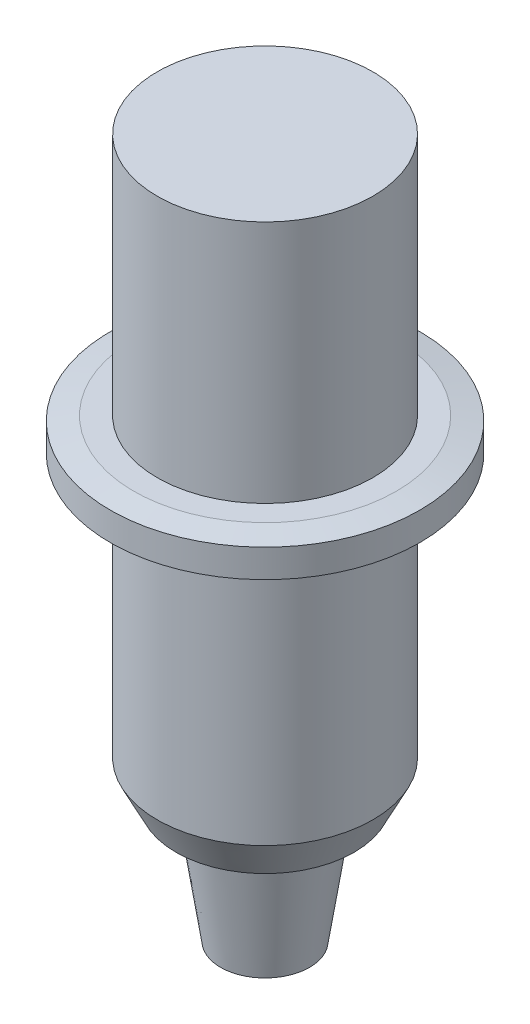
ISO-10303-21;
HEADER;
FILE_DESCRIPTION(('STEP AP214'),'2;1');
FILE_NAME('part.step','',(''),(''),'','','');
FILE_SCHEMA(('AUTOMOTIVE_DESIGN { 1 0 10303 214 1 1 1 1 }'));
ENDSEC;
DATA;
#1=APPLICATION_CONTEXT('core data for automotive mechanical design processes');
#2=APPLICATION_PROTOCOL_DEFINITION('international standard','automotive_design',2000,#1);
#3=PRODUCT_CONTEXT('',#1,'mechanical');
#4=PRODUCT('Part','Part','',(#3));
#5=PRODUCT_RELATED_PRODUCT_CATEGORY('part','',(#4));
#6=PRODUCT_DEFINITION_FORMATION('','',#4);
#7=PRODUCT_DEFINITION_CONTEXT('part definition',#1,'design');
#8=PRODUCT_DEFINITION('design','',#6,#7);
#9=PRODUCT_DEFINITION_SHAPE('','',#8);
#10=(LENGTH_UNIT() NAMED_UNIT(*) SI_UNIT(.MILLI.,.METRE.));
#11=(NAMED_UNIT(*) PLANE_ANGLE_UNIT() SI_UNIT($,.RADIAN.));
#12=(NAMED_UNIT(*) SI_UNIT($,.STERADIAN.) SOLID_ANGLE_UNIT());
#13=UNCERTAINTY_MEASURE_WITH_UNIT(LENGTH_MEASURE(1.E-05),#10,'distance_accuracy_value','');
#14=(GEOMETRIC_REPRESENTATION_CONTEXT(3) GLOBAL_UNCERTAINTY_ASSIGNED_CONTEXT((#13)) GLOBAL_UNIT_ASSIGNED_CONTEXT((#10,
#11,#12)) REPRESENTATION_CONTEXT('',''));
#15=CARTESIAN_POINT('',(0.,0.,0.));
#16=DIRECTION('',(0.,0.,1.));
#17=DIRECTION('',(1.,0.,0.));
#18=AXIS2_PLACEMENT_3D('',#15,#16,#17);
#19=CARTESIAN_POINT('',(0.,0.,0.));
#20=DIRECTION('',(0.,1.,0.));
#21=DIRECTION('',(-1.,0.,0.));
#22=AXIS2_PLACEMENT_3D('',#19,#20,#21);
#23=CONICAL_SURFACE('',#22,2.375,0.1488899476095);
#24=CARTESIAN_POINT('',(0.,5.50000000000001,0.));
#25=DIRECTION('',(0.,-1.,0.));
#26=DIRECTION('',(1.,0.,0.));
#27=AXIS2_PLACEMENT_3D('',#24,#25,#26);
#28=CIRCLE('',#27,3.20000000000002);
#29=CARTESIAN_POINT('',(3.2,5.50000000000002,0.));
#30=VERTEX_POINT('',#29);
#31=EDGE_CURVE('E10',#30,#30,#28,.T.);
#32=ORIENTED_EDGE('',*,*,#31,.T.);
#33=EDGE_LOOP('',(#32));
#34=FACE_BOUND('',#33,.T.);
#35=CARTESIAN_POINT('',(0.,0.,0.));
#36=DIRECTION('',(0.,-1.,0.));
#37=DIRECTION('',(1.,0.,0.));
#38=AXIS2_PLACEMENT_3D('',#35,#36,#37);
#39=CIRCLE('',#38,2.375);
#40=CARTESIAN_POINT('',(2.375,0.,0.));
#41=VERTEX_POINT('',#40);
#42=EDGE_CURVE('E71',#41,#41,#39,.T.);
#43=ORIENTED_EDGE('',*,*,#42,.F.);
#44=EDGE_LOOP('',(#43));
#45=FACE_BOUND('',#44,.T.);
#46=ADVANCED_FACE('F31',(#34,#45),#23,.T.);
#47=CARTESIAN_POINT('',(5.02600346399491E-13,-143.950460455854,0.));
#48=DIRECTION('',(0.,-1.,0.));
#49=DIRECTION('',(1.,0.,0.));
#50=AXIS2_PLACEMENT_3D('',#47,#48,#49);
#51=CYLINDRICAL_SURFACE('',#50,3.20000000000002);
#52=CARTESIAN_POINT('',(0.,6.50000000000001,0.));
#53=DIRECTION('',(0.,-1.,0.));
#54=DIRECTION('',(1.,0.,0.));
#55=AXIS2_PLACEMENT_3D('',#52,#53,#54);
#56=CIRCLE('',#55,3.20000000000002);
#57=CARTESIAN_POINT('',(3.2,6.50000000000002,0.));
#58=VERTEX_POINT('',#57);
#59=EDGE_CURVE('E37',#58,#58,#56,.T.);
#60=ORIENTED_EDGE('',*,*,#59,.T.);
#61=EDGE_LOOP('',(#60));
#62=FACE_BOUND('',#61,.T.);
#63=ORIENTED_EDGE('',*,*,#31,.F.);
#64=EDGE_LOOP('',(#63));
#65=FACE_BOUND('',#64,.T.);
#66=ADVANCED_FACE('F78',(#62,#65),#51,.T.);
#67=CARTESIAN_POINT('',(3.2,6.5,0.));
#68=DIRECTION('',(0.,-1.,0.));
#69=DIRECTION('',(1.,0.,0.));
#70=AXIS2_PLACEMENT_3D('',#67,#68,#69);
#71=PLANE('',#70);
#72=CARTESIAN_POINT('',(0.,6.49999999999998,0.));
#73=DIRECTION('',(0.,-1.,0.));
#74=DIRECTION('',(1.,0.,0.));
#75=AXIS2_PLACEMENT_3D('',#72,#73,#74);
#76=CIRCLE('',#75,4.75000000000002);
#77=CARTESIAN_POINT('',(4.75,6.49999999999999,0.));
#78=VERTEX_POINT('',#77);
#79=EDGE_CURVE('E41',#78,#78,#76,.T.);
#80=ORIENTED_EDGE('',*,*,#79,.T.);
#81=EDGE_LOOP('',(#80));
#82=FACE_BOUND('',#81,.T.);
#83=ORIENTED_EDGE('',*,*,#59,.F.);
#84=EDGE_LOOP('',(#83));
#85=FACE_BOUND('',#84,.T.);
#86=ADVANCED_FACE('F82',(#82,#85),#71,.T.);
#87=CARTESIAN_POINT('',(0.,6.49999999999998,0.));
#88=DIRECTION('',(0.,1.,0.));
#89=DIRECTION('',(-1.,0.,0.));
#90=AXIS2_PLACEMENT_3D('',#87,#88,#89);
#91=CONICAL_SURFACE('',#90,4.75000000000002,0.463647609000808);
#92=CARTESIAN_POINT('',(0.,8.49999999999998,0.));
#93=DIRECTION('',(0.,-1.,0.));
#94=DIRECTION('',(1.,0.,0.));
#95=AXIS2_PLACEMENT_3D('',#92,#93,#94);
#96=CIRCLE('',#95,5.75000000000003);
#97=CARTESIAN_POINT('',(5.75,8.5,0.));
#98=VERTEX_POINT('',#97);
#99=EDGE_CURVE('E45',#98,#98,#96,.T.);
#100=ORIENTED_EDGE('',*,*,#99,.T.);
#101=EDGE_LOOP('',(#100));
#102=FACE_BOUND('',#101,.T.);
#103=ORIENTED_EDGE('',*,*,#79,.F.);
#104=EDGE_LOOP('',(#103));
#105=FACE_BOUND('',#104,.T.);
#106=ADVANCED_FACE('F86',(#102,#105),#91,.T.);
#107=CARTESIAN_POINT('',(5.02600346399491E-13,-143.950460455854,0.));
#108=DIRECTION('',(0.,-1.,0.));
#109=DIRECTION('',(1.,0.,0.));
#110=AXIS2_PLACEMENT_3D('',#107,#108,#109);
#111=CYLINDRICAL_SURFACE('',#110,5.75000000000005);
#112=CARTESIAN_POINT('',(0.,22.3,0.));
#113=DIRECTION('',(0.,-1.,0.));
#114=DIRECTION('',(1.,0.,0.));
#115=AXIS2_PLACEMENT_3D('',#112,#113,#114);
#116=CIRCLE('',#115,5.75000000000008);
#117=CARTESIAN_POINT('',(5.75,22.3,0.));
#118=VERTEX_POINT('',#117);
#119=EDGE_CURVE('E50',#118,#118,#116,.T.);
#120=ORIENTED_EDGE('',*,*,#119,.T.);
#121=EDGE_LOOP('',(#120));
#122=FACE_BOUND('',#121,.T.);
#123=ORIENTED_EDGE('',*,*,#99,.F.);
#124=EDGE_LOOP('',(#123));
#125=FACE_BOUND('',#124,.T.);
#126=ADVANCED_FACE('F93',(#122,#125),#111,.T.);
#127=CARTESIAN_POINT('',(5.75,22.3,0.));
#128=DIRECTION('',(0.,-1.,0.));
#129=DIRECTION('',(1.,0.,0.));
#130=AXIS2_PLACEMENT_3D('',#127,#128,#129);
#131=PLANE('',#130);
#132=CARTESIAN_POINT('',(0.,22.3,0.));
#133=DIRECTION('',(0.,-1.,0.));
#134=DIRECTION('',(1.,0.,0.));
#135=AXIS2_PLACEMENT_3D('',#132,#133,#134);
#136=CIRCLE('',#135,7.00000000000008);
#137=CARTESIAN_POINT('',(7.,22.3,0.));
#138=VERTEX_POINT('',#137);
#139=EDGE_CURVE('E53',#138,#138,#136,.T.);
#140=ORIENTED_EDGE('',*,*,#139,.T.);
#141=EDGE_LOOP('',(#140));
#142=FACE_BOUND('',#141,.T.);
#143=ORIENTED_EDGE('',*,*,#119,.F.);
#144=EDGE_LOOP('',(#143));
#145=FACE_BOUND('',#144,.T.);
#146=ADVANCED_FACE('F97',(#142,#145),#131,.T.);
#147=CARTESIAN_POINT('',(0.,22.3,0.));
#148=DIRECTION('',(0.,1.,0.));
#149=DIRECTION('',(-1.,0.,0.));
#150=AXIS2_PLACEMENT_3D('',#147,#148,#149);
#151=CONICAL_SURFACE('',#150,7.00000000000008,1.37340076694502);
#152=CARTESIAN_POINT('',(0.,22.55,0.));
#153=DIRECTION('',(0.,-1.,0.));
#154=DIRECTION('',(1.,0.,0.));
#155=AXIS2_PLACEMENT_3D('',#152,#153,#154);
#156=CIRCLE('',#155,8.25000000000008);
#157=CARTESIAN_POINT('',(8.25,22.55,0.));
#158=VERTEX_POINT('',#157);
#159=EDGE_CURVE('E56',#158,#158,#156,.T.);
#160=ORIENTED_EDGE('',*,*,#159,.T.);
#161=EDGE_LOOP('',(#160));
#162=FACE_BOUND('',#161,.T.);
#163=ORIENTED_EDGE('',*,*,#139,.F.);
#164=EDGE_LOOP('',(#163));
#165=FACE_BOUND('',#164,.T.);
#166=ADVANCED_FACE('F101',(#162,#165),#151,.T.);
#167=CARTESIAN_POINT('',(5.02600346399491E-13,-143.950460455854,0.));
#168=DIRECTION('',(0.,-1.,0.));
#169=DIRECTION('',(1.,0.,0.));
#170=AXIS2_PLACEMENT_3D('',#167,#168,#169);
#171=CYLINDRICAL_SURFACE('',#170,8.25000000000008);
#172=CARTESIAN_POINT('',(0.,24.05,0.));
#173=DIRECTION('',(0.,-1.,0.));
#174=DIRECTION('',(1.,0.,0.));
#175=AXIS2_PLACEMENT_3D('',#172,#173,#174);
#176=CIRCLE('',#175,8.25000000000008);
#177=CARTESIAN_POINT('',(8.25,24.05,0.));
#178=VERTEX_POINT('',#177);
#179=EDGE_CURVE('E59',#178,#178,#176,.T.);
#180=ORIENTED_EDGE('',*,*,#179,.T.);
#181=EDGE_LOOP('',(#180));
#182=FACE_BOUND('',#181,.T.);
#183=ORIENTED_EDGE('',*,*,#159,.F.);
#184=EDGE_LOOP('',(#183));
#185=FACE_BOUND('',#184,.T.);
#186=ADVANCED_FACE('F105',(#182,#185),#171,.T.);
#187=CARTESIAN_POINT('',(0.,24.05,0.));
#188=DIRECTION('',(0.,-1.,0.));
#189=DIRECTION('',(1.,0.,0.));
#190=AXIS2_PLACEMENT_3D('',#187,#188,#189);
#191=CONICAL_SURFACE('',#190,8.25000000000008,1.37340076694502);
#192=CARTESIAN_POINT('',(0.,24.3,0.));
#193=DIRECTION('',(0.,-1.,0.));
#194=DIRECTION('',(1.,0.,0.));
#195=AXIS2_PLACEMENT_3D('',#192,#193,#194);
#196=CIRCLE('',#195,7.00000000000009);
#197=CARTESIAN_POINT('',(7.,24.3,0.));
#198=VERTEX_POINT('',#197);
#199=EDGE_CURVE('E62',#198,#198,#196,.T.);
#200=ORIENTED_EDGE('',*,*,#199,.T.);
#201=EDGE_LOOP('',(#200));
#202=FACE_BOUND('',#201,.T.);
#203=ORIENTED_EDGE('',*,*,#179,.F.);
#204=EDGE_LOOP('',(#203));
#205=FACE_BOUND('',#204,.T.);
#206=ADVANCED_FACE('F109',(#202,#205),#191,.T.);
#207=CARTESIAN_POINT('',(7.,24.3,0.));
#208=DIRECTION('',(0.,1.,0.));
#209=DIRECTION('',(-1.,0.,0.));
#210=AXIS2_PLACEMENT_3D('',#207,#208,#209);
#211=PLANE('',#210);
#212=CARTESIAN_POINT('',(0.,24.3,0.));
#213=DIRECTION('',(0.,-1.,0.));
#214=DIRECTION('',(1.,0.,0.));
#215=AXIS2_PLACEMENT_3D('',#212,#213,#214);
#216=CIRCLE('',#215,5.75000000000009);
#217=CARTESIAN_POINT('',(5.75,24.3,0.));
#218=VERTEX_POINT('',#217);
#219=EDGE_CURVE('E65',#218,#218,#216,.T.);
#220=ORIENTED_EDGE('',*,*,#219,.T.);
#221=EDGE_LOOP('',(#220));
#222=FACE_BOUND('',#221,.T.);
#223=ORIENTED_EDGE('',*,*,#199,.F.);
#224=EDGE_LOOP('',(#223));
#225=FACE_BOUND('',#224,.T.);
#226=ADVANCED_FACE('F113',(#222,#225),#211,.T.);
#227=CARTESIAN_POINT('',(5.02600346399491E-13,-143.950460455854,0.));
#228=DIRECTION('',(0.,-1.,0.));
#229=DIRECTION('',(1.,0.,0.));
#230=AXIS2_PLACEMENT_3D('',#227,#228,#229);
#231=CYLINDRICAL_SURFACE('',#230,5.75000000000011);
#232=CARTESIAN_POINT('',(-1.30232253938849E-13,37.3,0.));
#233=DIRECTION('',(0.,-1.,0.));
#234=DIRECTION('',(1.,0.,0.));
#235=AXIS2_PLACEMENT_3D('',#232,#233,#234);
#236=CIRCLE('',#235,5.75000000000013);
#237=CARTESIAN_POINT('',(5.75,37.3,0.));
#238=VERTEX_POINT('',#237);
#239=EDGE_CURVE('E68',#238,#238,#236,.T.);
#240=ORIENTED_EDGE('',*,*,#239,.T.);
#241=EDGE_LOOP('',(#240));
#242=FACE_BOUND('',#241,.T.);
#243=ORIENTED_EDGE('',*,*,#219,.F.);
#244=EDGE_LOOP('',(#243));
#245=FACE_BOUND('',#244,.T.);
#246=ADVANCED_FACE('F117',(#242,#245),#231,.T.);
#247=CARTESIAN_POINT('',(5.75,37.3,0.));
#248=DIRECTION('',(0.,1.,0.));
#249=DIRECTION('',(-1.,0.,0.));
#250=AXIS2_PLACEMENT_3D('',#247,#248,#249);
#251=PLANE('',#250);
#252=ORIENTED_EDGE('',*,*,#239,.F.);
#253=EDGE_LOOP('',(#252));
#254=FACE_BOUND('',#253,.T.);
#255=ADVANCED_FACE('F121',(#254),#251,.T.);
#256=CARTESIAN_POINT('',(0.,0.,0.));
#257=DIRECTION('',(0.,-1.,0.));
#258=DIRECTION('',(1.,0.,0.));
#259=AXIS2_PLACEMENT_3D('',#256,#257,#258);
#260=PLANE('',#259);
#261=ORIENTED_EDGE('',*,*,#42,.T.);
#262=EDGE_LOOP('',(#261));
#263=FACE_BOUND('',#262,.T.);
#264=ADVANCED_FACE('F75',(#263),#260,.T.);
#265=CLOSED_SHELL('',(#46,#66,#86,#106,#126,#146,#166,#186,#206,#226,#246,#255,#264));
#266=MANIFOLD_SOLID_BREP('B2',#265);
#267=ADVANCED_BREP_SHAPE_REPRESENTATION('',(#18,#266),#14);
#268=SHAPE_DEFINITION_REPRESENTATION(#9,#267);
ENDSEC;
END-ISO-10303-21;
